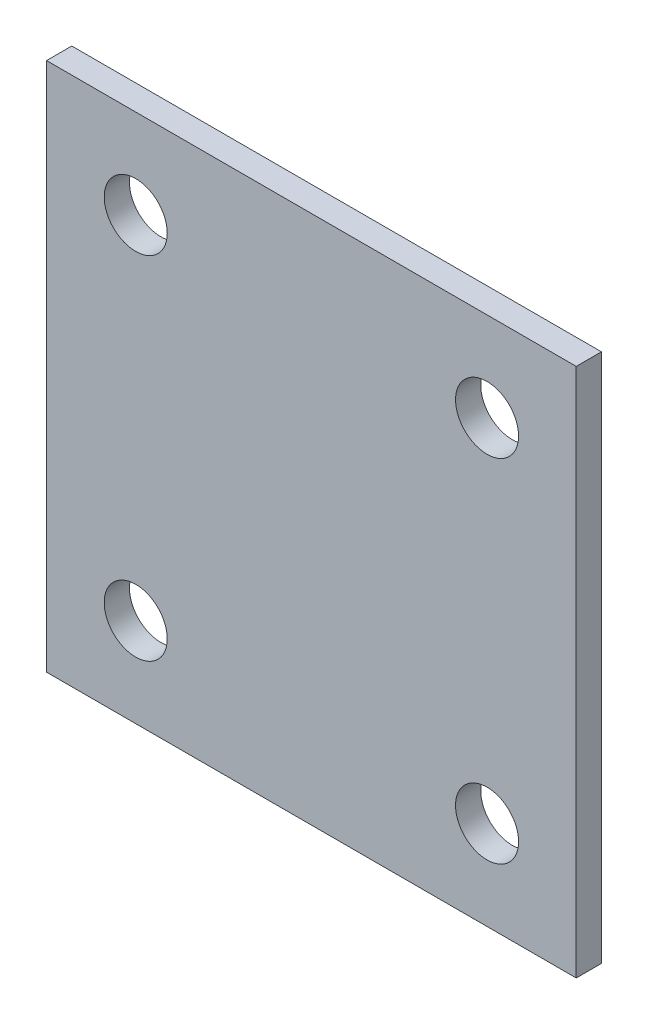
ISO-10303-21;
HEADER;
FILE_DESCRIPTION(('STEP AP214'),'2;1');
FILE_NAME('part.step','',(''),(''),'','','');
FILE_SCHEMA(('AUTOMOTIVE_DESIGN { 1 0 10303 214 1 1 1 1 }'));
ENDSEC;
DATA;
#1=APPLICATION_CONTEXT('core data for automotive mechanical design processes');
#2=APPLICATION_PROTOCOL_DEFINITION('international standard','automotive_design',2000,#1);
#3=PRODUCT_CONTEXT('',#1,'mechanical');
#4=PRODUCT('Part','Part','',(#3));
#5=PRODUCT_RELATED_PRODUCT_CATEGORY('part','',(#4));
#6=PRODUCT_DEFINITION_FORMATION('','',#4);
#7=PRODUCT_DEFINITION_CONTEXT('part definition',#1,'design');
#8=PRODUCT_DEFINITION('design','',#6,#7);
#9=PRODUCT_DEFINITION_SHAPE('','',#8);
#10=(LENGTH_UNIT() NAMED_UNIT(*) SI_UNIT(.MILLI.,.METRE.));
#11=(NAMED_UNIT(*) PLANE_ANGLE_UNIT() SI_UNIT($,.RADIAN.));
#12=(NAMED_UNIT(*) SI_UNIT($,.STERADIAN.) SOLID_ANGLE_UNIT());
#13=UNCERTAINTY_MEASURE_WITH_UNIT(LENGTH_MEASURE(1.E-05),#10,'distance_accuracy_value','');
#14=(GEOMETRIC_REPRESENTATION_CONTEXT(3) GLOBAL_UNCERTAINTY_ASSIGNED_CONTEXT((#13)) GLOBAL_UNIT_ASSIGNED_CONTEXT((#10,
#11,#12)) REPRESENTATION_CONTEXT('',''));
#15=CARTESIAN_POINT('',(0.,0.,0.));
#16=DIRECTION('',(0.,0.,1.));
#17=DIRECTION('',(1.,0.,0.));
#18=AXIS2_PLACEMENT_3D('',#15,#16,#17);
#19=CARTESIAN_POINT('',(-39.73062055735,-85.470150933321,5.08));
#20=DIRECTION('',(0.,0.,1.));
#21=DIRECTION('',(1.,0.,0.));
#22=AXIS2_PLACEMENT_3D('',#19,#20,#21);
#23=PLANE('',#22);
#24=CARTESIAN_POINT('',(-21.7701083152116,-67.5096386911827,5.08));
#25=DIRECTION('',(0.,0.,1.));
#26=DIRECTION('',(1.,0.,0.));
#27=AXIS2_PLACEMENT_3D('',#24,#25,#26);
#28=CIRCLE('',#27,6.35);
#29=CARTESIAN_POINT('',(-15.4201083152116,-67.5096386911827,5.08));
#30=VERTEX_POINT('',#29);
#31=EDGE_CURVE('E123',#30,#30,#28,.T.);
#32=ORIENTED_EDGE('',*,*,#31,.F.);
#33=EDGE_LOOP('',(#32));
#34=FACE_BOUND('',#33,.T.);
#35=CARTESIAN_POINT('',(-21.7701083152117,3.2493368245407,5.08));
#36=DIRECTION('',(0.,0.,1.));
#37=DIRECTION('',(1.,0.,0.));
#38=AXIS2_PLACEMENT_3D('',#35,#36,#37);
#39=CIRCLE('',#38,6.35);
#40=CARTESIAN_POINT('',(-15.4201083152117,3.2493368245407,5.08));
#41=VERTEX_POINT('',#40);
#42=EDGE_CURVE('E102',#41,#41,#39,.T.);
#43=ORIENTED_EDGE('',*,*,#42,.F.);
#44=EDGE_LOOP('',(#43));
#45=FACE_BOUND('',#44,.T.);
#46=DIRECTION('',(0.,-1.,0.));
#47=VECTOR('',#46,1.);
#48=CARTESIAN_POINT('',(-39.73062055735,21.209849066679,5.08));
#49=LINE('',#48,#47);
#50=CARTESIAN_POINT('',(-39.73062055735,21.209849066679,5.08));
#51=VERTEX_POINT('',#50);
#52=CARTESIAN_POINT('',(-39.73062055735,-85.470150933321,5.08));
#53=VERTEX_POINT('',#52);
#54=EDGE_CURVE('E87',#51,#53,#49,.T.);
#55=ORIENTED_EDGE('',*,*,#54,.T.);
#56=DIRECTION('',(1.,0.,0.));
#57=VECTOR('',#56,1.);
#58=CARTESIAN_POINT('',(-39.73062055735,-85.470150933321,5.08));
#59=LINE('',#58,#57);
#60=CARTESIAN_POINT('',(66.94937944265,-85.470150933321,5.08));
#61=VERTEX_POINT('',#60);
#62=EDGE_CURVE('E82',#53,#61,#59,.T.);
#63=ORIENTED_EDGE('',*,*,#62,.T.);
#64=DIRECTION('',(0.,1.,0.));
#65=VECTOR('',#64,1.);
#66=CARTESIAN_POINT('',(66.94937944265,21.209849066679,5.08));
#67=LINE('',#66,#65);
#68=CARTESIAN_POINT('',(66.94937944265,21.209849066679,5.08));
#69=VERTEX_POINT('',#68);
#70=EDGE_CURVE('E85',#61,#69,#67,.T.);
#71=ORIENTED_EDGE('',*,*,#70,.T.);
#72=DIRECTION('',(-1.,0.,0.));
#73=VECTOR('',#72,1.);
#74=CARTESIAN_POINT('',(-39.73062055735,21.209849066679,5.08));
#75=LINE('',#74,#73);
#76=EDGE_CURVE('E52',#69,#51,#75,.T.);
#77=ORIENTED_EDGE('',*,*,#76,.T.);
#78=EDGE_LOOP('',(#55,#63,#71,#77));
#79=FACE_BOUND('',#78,.T.);
#80=CARTESIAN_POINT('',(48.9888672005117,3.24933682454068,5.08));
#81=DIRECTION('',(0.,0.,1.));
#82=DIRECTION('',(1.,0.,0.));
#83=AXIS2_PLACEMENT_3D('',#80,#81,#82);
#84=CIRCLE('',#83,6.35);
#85=CARTESIAN_POINT('',(55.3388672005117,3.24933682454068,5.08));
#86=VERTEX_POINT('',#85);
#87=EDGE_CURVE('E117',#86,#86,#84,.T.);
#88=ORIENTED_EDGE('',*,*,#87,.F.);
#89=EDGE_LOOP('',(#88));
#90=FACE_BOUND('',#89,.T.);
#91=CARTESIAN_POINT('',(48.9888672005117,-67.5096386911827,5.08));
#92=DIRECTION('',(0.,0.,1.));
#93=DIRECTION('',(1.,0.,0.));
#94=AXIS2_PLACEMENT_3D('',#91,#92,#93);
#95=CIRCLE('',#94,6.35);
#96=CARTESIAN_POINT('',(55.3388672005117,-67.5096386911827,5.08));
#97=VERTEX_POINT('',#96);
#98=EDGE_CURVE('E129',#97,#97,#95,.T.);
#99=ORIENTED_EDGE('',*,*,#98,.F.);
#100=EDGE_LOOP('',(#99));
#101=FACE_BOUND('',#100,.T.);
#102=ADVANCED_FACE('F35',(#34,#45,#79,#90,#101),#23,.T.);
#103=CARTESIAN_POINT('',(-39.73062055735,-85.470150933321,0.));
#104=DIRECTION('',(0.,0.,1.));
#105=DIRECTION('',(1.,0.,0.));
#106=AXIS2_PLACEMENT_3D('',#103,#104,#105);
#107=PLANE('',#106);
#108=CARTESIAN_POINT('',(-21.7701083152116,-67.5096386911827,0.));
#109=DIRECTION('',(0.,0.,1.));
#110=DIRECTION('',(1.,0.,0.));
#111=AXIS2_PLACEMENT_3D('',#108,#109,#110);
#112=CIRCLE('',#111,6.35);
#113=CARTESIAN_POINT('',(-15.4201083152116,-67.5096386911827,0.));
#114=VERTEX_POINT('',#113);
#115=EDGE_CURVE('E126',#114,#114,#112,.T.);
#116=ORIENTED_EDGE('',*,*,#115,.T.);
#117=EDGE_LOOP('',(#116));
#118=FACE_BOUND('',#117,.T.);
#119=CARTESIAN_POINT('',(-21.7701083152117,3.2493368245407,0.));
#120=DIRECTION('',(0.,0.,1.));
#121=DIRECTION('',(1.,0.,0.));
#122=AXIS2_PLACEMENT_3D('',#119,#120,#121);
#123=CIRCLE('',#122,6.35);
#124=CARTESIAN_POINT('',(-15.4201083152117,3.2493368245407,0.));
#125=VERTEX_POINT('',#124);
#126=EDGE_CURVE('E114',#125,#125,#123,.T.);
#127=ORIENTED_EDGE('',*,*,#126,.T.);
#128=EDGE_LOOP('',(#127));
#129=FACE_BOUND('',#128,.T.);
#130=DIRECTION('',(0.,-1.,0.));
#131=VECTOR('',#130,1.);
#132=CARTESIAN_POINT('',(-39.73062055735,21.209849066679,0.));
#133=LINE('',#132,#131);
#134=CARTESIAN_POINT('',(-39.73062055735,21.209849066679,0.));
#135=VERTEX_POINT('',#134);
#136=CARTESIAN_POINT('',(-39.73062055735,-85.470150933321,0.));
#137=VERTEX_POINT('',#136);
#138=EDGE_CURVE('E99',#135,#137,#133,.T.);
#139=ORIENTED_EDGE('',*,*,#138,.F.);
#140=DIRECTION('',(-1.,0.,0.));
#141=VECTOR('',#140,1.);
#142=CARTESIAN_POINT('',(-39.73062055735,21.209849066679,0.));
#143=LINE('',#142,#141);
#144=CARTESIAN_POINT('',(66.94937944265,21.209849066679,0.));
#145=VERTEX_POINT('',#144);
#146=EDGE_CURVE('E75',#145,#135,#143,.T.);
#147=ORIENTED_EDGE('',*,*,#146,.F.);
#148=DIRECTION('',(0.,1.,0.));
#149=VECTOR('',#148,1.);
#150=CARTESIAN_POINT('',(66.94937944265,21.209849066679,0.));
#151=LINE('',#150,#149);
#152=CARTESIAN_POINT('',(66.94937944265,-85.470150933321,0.));
#153=VERTEX_POINT('',#152);
#154=EDGE_CURVE('E69',#153,#145,#151,.T.);
#155=ORIENTED_EDGE('',*,*,#154,.F.);
#156=DIRECTION('',(1.,0.,0.));
#157=VECTOR('',#156,1.);
#158=CARTESIAN_POINT('',(-39.73062055735,-85.470150933321,0.));
#159=LINE('',#158,#157);
#160=EDGE_CURVE('E91',#137,#153,#159,.T.);
#161=ORIENTED_EDGE('',*,*,#160,.F.);
#162=EDGE_LOOP('',(#139,#147,#155,#161));
#163=FACE_BOUND('',#162,.T.);
#164=CARTESIAN_POINT('',(48.9888672005117,3.24933682454068,0.));
#165=DIRECTION('',(0.,0.,1.));
#166=DIRECTION('',(1.,0.,0.));
#167=AXIS2_PLACEMENT_3D('',#164,#165,#166);
#168=CIRCLE('',#167,6.35);
#169=CARTESIAN_POINT('',(55.3388672005117,3.24933682454068,0.));
#170=VERTEX_POINT('',#169);
#171=EDGE_CURVE('E120',#170,#170,#168,.T.);
#172=ORIENTED_EDGE('',*,*,#171,.T.);
#173=EDGE_LOOP('',(#172));
#174=FACE_BOUND('',#173,.T.);
#175=CARTESIAN_POINT('',(48.9888672005117,-67.5096386911827,0.));
#176=DIRECTION('',(0.,0.,1.));
#177=DIRECTION('',(1.,0.,0.));
#178=AXIS2_PLACEMENT_3D('',#175,#176,#177);
#179=CIRCLE('',#178,6.35);
#180=CARTESIAN_POINT('',(55.3388672005117,-67.5096386911827,0.));
#181=VERTEX_POINT('',#180);
#182=EDGE_CURVE('E132',#181,#181,#179,.T.);
#183=ORIENTED_EDGE('',*,*,#182,.T.);
#184=EDGE_LOOP('',(#183));
#185=FACE_BOUND('',#184,.T.);
#186=ADVANCED_FACE('F110',(#118,#129,#163,#174,#185),#107,.F.);
#187=CARTESIAN_POINT('',(-39.73062055735,21.209849066679,5.08));
#188=DIRECTION('',(1.,0.,0.));
#189=DIRECTION('',(0.,1.,0.));
#190=AXIS2_PLACEMENT_3D('',#187,#188,#189);
#191=PLANE('',#190);
#192=ORIENTED_EDGE('',*,*,#138,.T.);
#193=DIRECTION('',(0.,0.,-1.));
#194=VECTOR('',#193,1.);
#195=CARTESIAN_POINT('',(-39.73062055735,-85.470150933321,5.08));
#196=LINE('',#195,#194);
#197=EDGE_CURVE('E11',#53,#137,#196,.T.);
#198=ORIENTED_EDGE('',*,*,#197,.F.);
#199=ORIENTED_EDGE('',*,*,#54,.F.);
#200=DIRECTION('',(0.,0.,-1.));
#201=VECTOR('',#200,1.);
#202=CARTESIAN_POINT('',(-39.73062055735,21.209849066679,5.08));
#203=LINE('',#202,#201);
#204=EDGE_CURVE('E95',#51,#135,#203,.T.);
#205=ORIENTED_EDGE('',*,*,#204,.T.);
#206=EDGE_LOOP('',(#192,#198,#199,#205));
#207=FACE_BOUND('',#206,.T.);
#208=ADVANCED_FACE('F37',(#207),#191,.F.);
#209=CARTESIAN_POINT('',(-39.73062055735,-85.470150933321,5.08));
#210=DIRECTION('',(0.,1.,0.));
#211=DIRECTION('',(0.,0.,1.));
#212=AXIS2_PLACEMENT_3D('',#209,#210,#211);
#213=PLANE('',#212);
#214=ORIENTED_EDGE('',*,*,#160,.T.);
#215=DIRECTION('',(0.,0.,-1.));
#216=VECTOR('',#215,1.);
#217=CARTESIAN_POINT('',(66.94937944265,-85.470150933321,5.08));
#218=LINE('',#217,#216);
#219=EDGE_CURVE('E44',#61,#153,#218,.T.);
#220=ORIENTED_EDGE('',*,*,#219,.F.);
#221=ORIENTED_EDGE('',*,*,#62,.F.);
#222=ORIENTED_EDGE('',*,*,#197,.T.);
#223=EDGE_LOOP('',(#214,#220,#221,#222));
#224=FACE_BOUND('',#223,.T.);
#225=ADVANCED_FACE('F90',(#224),#213,.F.);
#226=CARTESIAN_POINT('',(66.94937944265,21.209849066679,5.08));
#227=DIRECTION('',(-1.,0.,0.));
#228=DIRECTION('',(0.,-1.,0.));
#229=AXIS2_PLACEMENT_3D('',#226,#227,#228);
#230=PLANE('',#229);
#231=ORIENTED_EDGE('',*,*,#154,.T.);
#232=DIRECTION('',(0.,0.,-1.));
#233=VECTOR('',#232,1.);
#234=CARTESIAN_POINT('',(66.94937944265,21.209849066679,5.08));
#235=LINE('',#234,#233);
#236=EDGE_CURVE('E92',#69,#145,#235,.T.);
#237=ORIENTED_EDGE('',*,*,#236,.F.);
#238=ORIENTED_EDGE('',*,*,#70,.F.);
#239=ORIENTED_EDGE('',*,*,#219,.T.);
#240=EDGE_LOOP('',(#231,#237,#238,#239));
#241=FACE_BOUND('',#240,.T.);
#242=ADVANCED_FACE('F93',(#241),#230,.F.);
#243=CARTESIAN_POINT('',(-39.73062055735,21.209849066679,5.08));
#244=DIRECTION('',(0.,-1.,0.));
#245=DIRECTION('',(0.,0.,-1.));
#246=AXIS2_PLACEMENT_3D('',#243,#244,#245);
#247=PLANE('',#246);
#248=ORIENTED_EDGE('',*,*,#146,.T.);
#249=ORIENTED_EDGE('',*,*,#204,.F.);
#250=ORIENTED_EDGE('',*,*,#76,.F.);
#251=ORIENTED_EDGE('',*,*,#236,.T.);
#252=EDGE_LOOP('',(#248,#249,#250,#251));
#253=FACE_BOUND('',#252,.T.);
#254=ADVANCED_FACE('F107',(#253),#247,.F.);
#255=CARTESIAN_POINT('',(-21.7701083152117,3.2493368245407,5.08));
#256=DIRECTION('',(0.,0.,-1.));
#257=DIRECTION('',(-1.,0.,0.));
#258=AXIS2_PLACEMENT_3D('',#255,#256,#257);
#259=CYLINDRICAL_SURFACE('',#258,6.35);
#260=ORIENTED_EDGE('',*,*,#42,.T.);
#261=EDGE_LOOP('',(#260));
#262=FACE_BOUND('',#261,.T.);
#263=ORIENTED_EDGE('',*,*,#126,.F.);
#264=EDGE_LOOP('',(#263));
#265=FACE_BOUND('',#264,.T.);
#266=ADVANCED_FACE('F152',(#262,#265),#259,.F.);
#267=CARTESIAN_POINT('',(48.9888672005117,3.24933682454068,5.08));
#268=DIRECTION('',(0.,0.,-1.));
#269=DIRECTION('',(-1.,0.,0.));
#270=AXIS2_PLACEMENT_3D('',#267,#268,#269);
#271=CYLINDRICAL_SURFACE('',#270,6.35);
#272=ORIENTED_EDGE('',*,*,#87,.T.);
#273=EDGE_LOOP('',(#272));
#274=FACE_BOUND('',#273,.T.);
#275=ORIENTED_EDGE('',*,*,#171,.F.);
#276=EDGE_LOOP('',(#275));
#277=FACE_BOUND('',#276,.T.);
#278=ADVANCED_FACE('F198',(#274,#277),#271,.F.);
#279=CARTESIAN_POINT('',(-21.7701083152116,-67.5096386911827,5.08));
#280=DIRECTION('',(0.,0.,-1.));
#281=DIRECTION('',(-1.,0.,0.));
#282=AXIS2_PLACEMENT_3D('',#279,#280,#281);
#283=CYLINDRICAL_SURFACE('',#282,6.35);
#284=ORIENTED_EDGE('',*,*,#31,.T.);
#285=EDGE_LOOP('',(#284));
#286=FACE_BOUND('',#285,.T.);
#287=ORIENTED_EDGE('',*,*,#115,.F.);
#288=EDGE_LOOP('',(#287));
#289=FACE_BOUND('',#288,.T.);
#290=ADVANCED_FACE('F206',(#286,#289),#283,.F.);
#291=CARTESIAN_POINT('',(48.9888672005117,-67.5096386911827,5.08));
#292=DIRECTION('',(0.,0.,-1.));
#293=DIRECTION('',(-1.,0.,0.));
#294=AXIS2_PLACEMENT_3D('',#291,#292,#293);
#295=CYLINDRICAL_SURFACE('',#294,6.35);
#296=ORIENTED_EDGE('',*,*,#98,.T.);
#297=EDGE_LOOP('',(#296));
#298=FACE_BOUND('',#297,.T.);
#299=ORIENTED_EDGE('',*,*,#182,.F.);
#300=EDGE_LOOP('',(#299));
#301=FACE_BOUND('',#300,.T.);
#302=ADVANCED_FACE('F138',(#298,#301),#295,.F.);
#303=CLOSED_SHELL('',(#102,#186,#208,#225,#242,#254,#266,#278,#290,#302));
#304=MANIFOLD_SOLID_BREP('B2',#303);
#305=ADVANCED_BREP_SHAPE_REPRESENTATION('',(#18,#304),#14);
#306=SHAPE_DEFINITION_REPRESENTATION(#9,#305);
ENDSEC;
END-ISO-10303-21;
